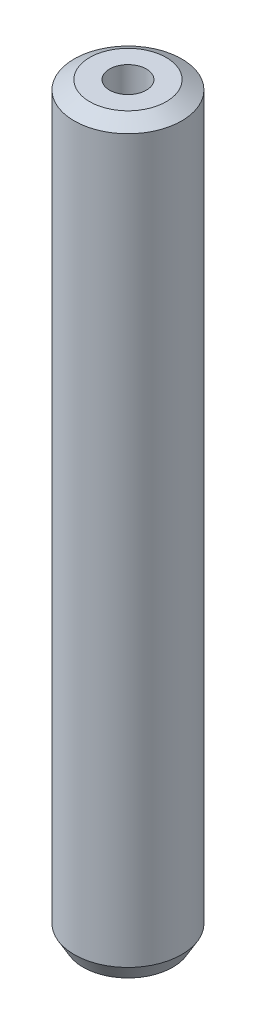
ISO-10303-21;
HEADER;
FILE_DESCRIPTION(('STEP AP214'),'2;1');
FILE_NAME('part.step','',(''),(''),'','','');
FILE_SCHEMA(('AUTOMOTIVE_DESIGN { 1 0 10303 214 1 1 1 1 }'));
ENDSEC;
DATA;
#1=APPLICATION_CONTEXT('core data for automotive mechanical design processes');
#2=APPLICATION_PROTOCOL_DEFINITION('international standard','automotive_design',2000,#1);
#3=PRODUCT_CONTEXT('',#1,'mechanical');
#4=PRODUCT('Part','Part','',(#3));
#5=PRODUCT_RELATED_PRODUCT_CATEGORY('part','',(#4));
#6=PRODUCT_DEFINITION_FORMATION('','',#4);
#7=PRODUCT_DEFINITION_CONTEXT('part definition',#1,'design');
#8=PRODUCT_DEFINITION('design','',#6,#7);
#9=PRODUCT_DEFINITION_SHAPE('','',#8);
#10=(LENGTH_UNIT() NAMED_UNIT(*) SI_UNIT(.MILLI.,.METRE.));
#11=(NAMED_UNIT(*) PLANE_ANGLE_UNIT() SI_UNIT($,.RADIAN.));
#12=(NAMED_UNIT(*) SI_UNIT($,.STERADIAN.) SOLID_ANGLE_UNIT());
#13=UNCERTAINTY_MEASURE_WITH_UNIT(LENGTH_MEASURE(1.E-05),#10,'distance_accuracy_value','');
#14=(GEOMETRIC_REPRESENTATION_CONTEXT(3) GLOBAL_UNCERTAINTY_ASSIGNED_CONTEXT((#13)) GLOBAL_UNIT_ASSIGNED_CONTEXT((#10,
#11,#12)) REPRESENTATION_CONTEXT('',''));
#15=CARTESIAN_POINT('',(0.,0.,0.));
#16=DIRECTION('',(0.,0.,1.));
#17=DIRECTION('',(1.,0.,0.));
#18=AXIS2_PLACEMENT_3D('',#15,#16,#17);
#19=CARTESIAN_POINT('',(0.,208.281163662247,0.));
#20=DIRECTION('',(0.,-1.,0.));
#21=DIRECTION('',(0.,0.,-1.));
#22=AXIS2_PLACEMENT_3D('',#19,#20,#21);
#23=CYLINDRICAL_SURFACE('',#22,15.);
#24=CARTESIAN_POINT('',(0.,205.789670046163,0.));
#25=DIRECTION('',(0.,1.,0.));
#26=DIRECTION('',(0.,0.,1.));
#27=AXIS2_PLACEMENT_3D('',#24,#25,#26);
#28=CIRCLE('',#27,15.);
#29=CARTESIAN_POINT('',(0.,205.789670046163,15.));
#30=VERTEX_POINT('',#29);
#31=EDGE_CURVE('E50',#30,#30,#28,.F.);
#32=ORIENTED_EDGE('',*,*,#31,.T.);
#33=EDGE_LOOP('',(#32));
#34=FACE_BOUND('',#33,.T.);
#35=CARTESIAN_POINT('',(0.,4.31539352979188,0.));
#36=DIRECTION('',(0.,1.,0.));
#37=DIRECTION('',(0.,0.,1.));
#38=AXIS2_PLACEMENT_3D('',#35,#36,#37);
#39=CIRCLE('',#38,15.);
#40=CARTESIAN_POINT('',(0.,4.31539352979188,15.));
#41=VERTEX_POINT('',#40);
#42=EDGE_CURVE('E51',#41,#41,#39,.T.);
#43=ORIENTED_EDGE('',*,*,#42,.T.);
#44=EDGE_LOOP('',(#43));
#45=FACE_BOUND('',#44,.T.);
#46=ADVANCED_FACE('F39',(#34,#45),#23,.T.);
#47=CARTESIAN_POINT('',(0.,208.281163662247,0.));
#48=DIRECTION('',(0.,1.,0.));
#49=DIRECTION('',(0.,0.,1.));
#50=AXIS2_PLACEMENT_3D('',#47,#48,#49);
#51=PLANE('',#50);
#52=CARTESIAN_POINT('',(0.,208.281163662247,0.));
#53=DIRECTION('',(0.,1.,0.));
#54=DIRECTION('',(0.,0.,1.));
#55=AXIS2_PLACEMENT_3D('',#52,#53,#54);
#56=CIRCLE('',#55,10.6846064702081);
#57=CARTESIAN_POINT('',(0.,208.281163662247,10.6846064702081));
#58=VERTEX_POINT('',#57);
#59=EDGE_CURVE('E54',#58,#58,#56,.T.);
#60=ORIENTED_EDGE('',*,*,#59,.T.);
#61=EDGE_LOOP('',(#60));
#62=FACE_BOUND('',#61,.T.);
#63=CARTESIAN_POINT('',(0.,208.281163662247,0.));
#64=DIRECTION('',(0.,1.,0.));
#65=DIRECTION('',(0.,0.,1.));
#66=AXIS2_PLACEMENT_3D('',#63,#64,#65);
#67=CIRCLE('',#66,5.12779719743579);
#68=CARTESIAN_POINT('',(0.,208.281163662247,5.12779719743579));
#69=VERTEX_POINT('',#68);
#70=EDGE_CURVE('E58',#69,#69,#67,.T.);
#71=ORIENTED_EDGE('',*,*,#70,.F.);
#72=EDGE_LOOP('',(#71));
#73=FACE_BOUND('',#72,.T.);
#74=ADVANCED_FACE('F69',(#62,#73),#51,.T.);
#75=CARTESIAN_POINT('',(0.,0.,0.));
#76=DIRECTION('',(0.,1.,0.));
#77=DIRECTION('',(0.,0.,1.));
#78=AXIS2_PLACEMENT_3D('',#75,#76,#77);
#79=PLANE('',#78);
#80=CARTESIAN_POINT('',(0.,0.,0.));
#81=DIRECTION('',(0.,1.,0.));
#82=DIRECTION('',(0.,0.,1.));
#83=AXIS2_PLACEMENT_3D('',#80,#81,#82);
#84=CIRCLE('',#83,12.5085063839155);
#85=CARTESIAN_POINT('',(0.,0.,12.5085063839155));
#86=VERTEX_POINT('',#85);
#87=EDGE_CURVE('E10',#86,#86,#84,.F.);
#88=ORIENTED_EDGE('',*,*,#87,.T.);
#89=EDGE_LOOP('',(#88));
#90=FACE_BOUND('',#89,.T.);
#91=CARTESIAN_POINT('',(0.,0.,0.));
#92=DIRECTION('',(0.,1.,0.));
#93=DIRECTION('',(0.,0.,1.));
#94=AXIS2_PLACEMENT_3D('',#91,#92,#93);
#95=CIRCLE('',#94,5.12779719743579);
#96=CARTESIAN_POINT('',(0.,0.,5.12779719743579));
#97=VERTEX_POINT('',#96);
#98=EDGE_CURVE('E63',#97,#97,#95,.T.);
#99=ORIENTED_EDGE('',*,*,#98,.T.);
#100=EDGE_LOOP('',(#99));
#101=FACE_BOUND('',#100,.T.);
#102=ADVANCED_FACE('F75',(#90,#101),#79,.F.);
#103=CARTESIAN_POINT('',(0.,208.281163662247,0.));
#104=DIRECTION('',(0.,-1.,0.));
#105=DIRECTION('',(0.,0.,-1.));
#106=AXIS2_PLACEMENT_3D('',#103,#104,#105);
#107=CYLINDRICAL_SURFACE('',#106,5.12779719743579);
#108=ORIENTED_EDGE('',*,*,#70,.T.);
#109=EDGE_LOOP('',(#108));
#110=FACE_BOUND('',#109,.T.);
#111=ORIENTED_EDGE('',*,*,#98,.F.);
#112=EDGE_LOOP('',(#111));
#113=FACE_BOUND('',#112,.T.);
#114=ADVANCED_FACE('F70',(#110,#113),#107,.F.);
#115=CARTESIAN_POINT('',(0.,208.281163662247,0.));
#116=DIRECTION('',(0.,-1.,0.));
#117=DIRECTION('',(0.,0.,-1.));
#118=AXIS2_PLACEMENT_3D('',#115,#116,#117);
#119=CONICAL_SURFACE('',#118,10.6846064702081,1.04719755119659);
#120=ORIENTED_EDGE('',*,*,#31,.F.);
#121=EDGE_LOOP('',(#120));
#122=FACE_BOUND('',#121,.T.);
#123=ORIENTED_EDGE('',*,*,#59,.F.);
#124=EDGE_LOOP('',(#123));
#125=FACE_BOUND('',#124,.T.);
#126=ADVANCED_FACE('F81',(#122,#125),#119,.T.);
#127=CARTESIAN_POINT('',(0.,4.31539352979188,0.));
#128=DIRECTION('',(0.,1.,0.));
#129=DIRECTION('',(0.,0.,1.));
#130=AXIS2_PLACEMENT_3D('',#127,#128,#129);
#131=CONICAL_SURFACE('',#130,15.,0.523598775598302);
#132=ORIENTED_EDGE('',*,*,#87,.F.);
#133=EDGE_LOOP('',(#132));
#134=FACE_BOUND('',#133,.T.);
#135=ORIENTED_EDGE('',*,*,#42,.F.);
#136=EDGE_LOOP('',(#135));
#137=FACE_BOUND('',#136,.T.);
#138=ADVANCED_FACE('F45',(#134,#137),#131,.T.);
#139=CLOSED_SHELL('',(#46,#74,#102,#114,#126,#138));
#140=MANIFOLD_SOLID_BREP('B2',#139);
#141=ADVANCED_BREP_SHAPE_REPRESENTATION('',(#18,#140),#14);
#142=SHAPE_DEFINITION_REPRESENTATION(#9,#141);
ENDSEC;
END-ISO-10303-21;
